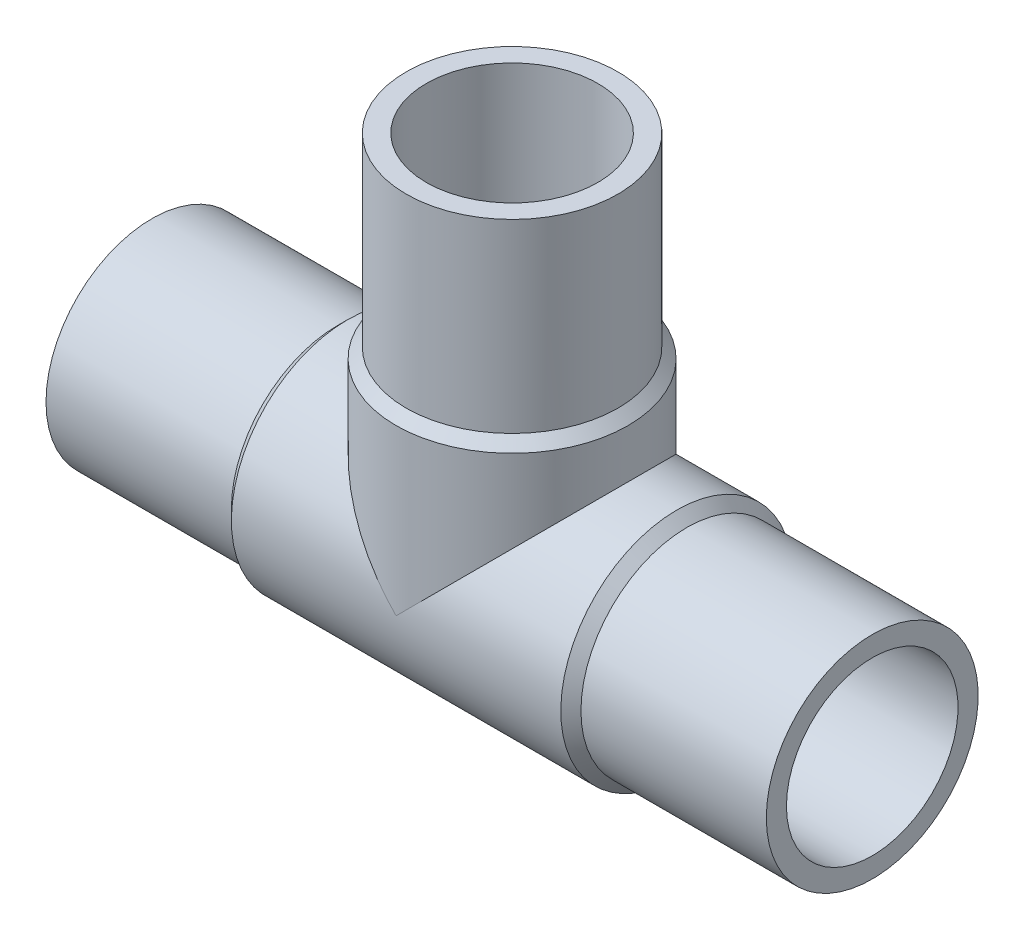
ISO-10303-21;
HEADER;
FILE_DESCRIPTION(('STEP AP214'),'2;1');
FILE_NAME('part.step','',(''),(''),'','','');
FILE_SCHEMA(('AUTOMOTIVE_DESIGN { 1 0 10303 214 1 1 1 1 }'));
ENDSEC;
DATA;
#1=APPLICATION_CONTEXT('core data for automotive mechanical design processes');
#2=APPLICATION_PROTOCOL_DEFINITION('international standard','automotive_design',2000,#1);
#3=PRODUCT_CONTEXT('',#1,'mechanical');
#4=PRODUCT('Part','Part','',(#3));
#5=PRODUCT_RELATED_PRODUCT_CATEGORY('part','',(#4));
#6=PRODUCT_DEFINITION_FORMATION('','',#4);
#7=PRODUCT_DEFINITION_CONTEXT('part definition',#1,'design');
#8=PRODUCT_DEFINITION('design','',#6,#7);
#9=PRODUCT_DEFINITION_SHAPE('','',#8);
#10=(LENGTH_UNIT() NAMED_UNIT(*) SI_UNIT(.MILLI.,.METRE.));
#11=(NAMED_UNIT(*) PLANE_ANGLE_UNIT() SI_UNIT($,.RADIAN.));
#12=(NAMED_UNIT(*) SI_UNIT($,.STERADIAN.) SOLID_ANGLE_UNIT());
#13=UNCERTAINTY_MEASURE_WITH_UNIT(LENGTH_MEASURE(1.E-05),#10,'distance_accuracy_value','');
#14=(GEOMETRIC_REPRESENTATION_CONTEXT(3) GLOBAL_UNCERTAINTY_ASSIGNED_CONTEXT((#13)) GLOBAL_UNIT_ASSIGNED_CONTEXT((#10,
#11,#12)) REPRESENTATION_CONTEXT('',''));
#15=CARTESIAN_POINT('',(0.,0.,0.));
#16=DIRECTION('',(0.,0.,1.));
#17=DIRECTION('',(1.,0.,0.));
#18=AXIS2_PLACEMENT_3D('',#15,#16,#17);
#19=CARTESIAN_POINT('',(-34.,34.,0.));
#20=DIRECTION('',(0.,1.,0.));
#21=DIRECTION('',(0.,0.,1.));
#22=AXIS2_PLACEMENT_3D('',#19,#20,#21);
#23=CYLINDRICAL_SURFACE('',#22,10.);
#24=CARTESIAN_POINT('',(-34.,34.,0.));
#25=DIRECTION('',(0.,1.,0.));
#26=DIRECTION('',(0.,0.,1.));
#27=AXIS2_PLACEMENT_3D('',#24,#25,#26);
#28=CIRCLE('',#27,10.);
#29=CARTESIAN_POINT('',(-34.,34.,10.));
#30=VERTEX_POINT('',#29);
#31=EDGE_CURVE('E18',#30,#30,#28,.T.);
#32=ORIENTED_EDGE('',*,*,#31,.F.);
#33=EDGE_LOOP('',(#32));
#34=FACE_BOUND('',#33,.T.);
#35=CARTESIAN_POINT('',(-34.,16.5,0.));
#36=DIRECTION('',(0.,1.,0.));
#37=DIRECTION('',(1.,0.,0.));
#38=AXIS2_PLACEMENT_3D('',#35,#36,#37);
#39=CIRCLE('',#38,9.99999999999999);
#40=CARTESIAN_POINT('',(-24.,16.5,0.));
#41=VERTEX_POINT('',#40);
#42=EDGE_CURVE('E71',#41,#41,#39,.F.);
#43=ORIENTED_EDGE('',*,*,#42,.F.);
#44=EDGE_LOOP('',(#43));
#45=FACE_BOUND('',#44,.T.);
#46=ADVANCED_FACE('F15',(#34,#45),#23,.T.);
#47=CARTESIAN_POINT('',(-34.,16.5,0.));
#48=DIRECTION('',(0.,-1.,0.));
#49=DIRECTION('',(0.,0.,-1.));
#50=AXIS2_PLACEMENT_3D('',#47,#48,#49);
#51=CONICAL_SURFACE('',#50,9.99999999999999,0.785398163397454);
#52=CARTESIAN_POINT('',(-34.,15.55,0.));
#53=DIRECTION('',(0.,1.,0.));
#54=DIRECTION('',(1.,0.,0.));
#55=AXIS2_PLACEMENT_3D('',#52,#53,#54);
#56=CIRCLE('',#55,10.95);
#57=CARTESIAN_POINT('',(-23.05,15.55,0.));
#58=VERTEX_POINT('',#57);
#59=EDGE_CURVE('E60',#58,#58,#56,.F.);
#60=ORIENTED_EDGE('',*,*,#59,.F.);
#61=EDGE_LOOP('',(#60));
#62=FACE_BOUND('',#61,.T.);
#63=ORIENTED_EDGE('',*,*,#42,.T.);
#64=EDGE_LOOP('',(#63));
#65=FACE_BOUND('',#64,.T.);
#66=ADVANCED_FACE('F141',(#62,#65),#51,.T.);
#67=CARTESIAN_POINT('',(-17.5,0.,0.));
#68=DIRECTION('',(-1.,0.,0.));
#69=DIRECTION('',(0.,0.,1.));
#70=AXIS2_PLACEMENT_3D('',#67,#68,#69);
#71=CYLINDRICAL_SURFACE('',#70,10.);
#72=CARTESIAN_POINT('',(-17.5,0.,0.));
#73=DIRECTION('',(1.,0.,0.));
#74=DIRECTION('',(0.,1.,0.));
#75=AXIS2_PLACEMENT_3D('',#72,#73,#74);
#76=CIRCLE('',#75,10.);
#77=CARTESIAN_POINT('',(-17.5,10.,0.));
#78=VERTEX_POINT('',#77);
#79=EDGE_CURVE('E64',#78,#78,#76,.F.);
#80=ORIENTED_EDGE('',*,*,#79,.F.);
#81=EDGE_LOOP('',(#80));
#82=FACE_BOUND('',#81,.T.);
#83=CARTESIAN_POINT('',(0.,0.,0.));
#84=DIRECTION('',(-1.,0.,0.));
#85=DIRECTION('',(0.,0.,1.));
#86=AXIS2_PLACEMENT_3D('',#83,#84,#85);
#87=CIRCLE('',#86,10.);
#88=CARTESIAN_POINT('',(0.,0.,10.));
#89=VERTEX_POINT('',#88);
#90=EDGE_CURVE('E58',#89,#89,#87,.F.);
#91=ORIENTED_EDGE('',*,*,#90,.F.);
#92=EDGE_LOOP('',(#91));
#93=FACE_BOUND('',#92,.T.);
#94=ADVANCED_FACE('F136',(#82,#93),#71,.T.);
#95=CARTESIAN_POINT('',(-44.,34.,10.1200021082875));
#96=DIRECTION('',(0.,1.,0.));
#97=DIRECTION('',(1.,0.,0.));
#98=AXIS2_PLACEMENT_3D('',#95,#96,#97);
#99=PLANE('',#98);
#100=CARTESIAN_POINT('',(-34.,34.,0.));
#101=DIRECTION('',(0.,1.,0.));
#102=DIRECTION('',(0.,0.,1.));
#103=AXIS2_PLACEMENT_3D('',#100,#101,#102);
#104=CIRCLE('',#103,8.1);
#105=CARTESIAN_POINT('',(-34.,34.,8.1));
#106=VERTEX_POINT('',#105);
#107=EDGE_CURVE('E52',#106,#106,#104,.T.);
#108=ORIENTED_EDGE('',*,*,#107,.F.);
#109=EDGE_LOOP('',(#108));
#110=FACE_BOUND('',#109,.T.);
#111=ORIENTED_EDGE('',*,*,#31,.T.);
#112=EDGE_LOOP('',(#111));
#113=FACE_BOUND('',#112,.T.);
#114=ADVANCED_FACE('F130',(#110,#113),#99,.T.);
#115=CARTESIAN_POINT('',(-17.5,0.,0.));
#116=DIRECTION('',(-1.,0.,0.));
#117=DIRECTION('',(0.,0.,1.));
#118=AXIS2_PLACEMENT_3D('',#115,#116,#117);
#119=CONICAL_SURFACE('',#118,10.,0.785398163397438);
#120=ORIENTED_EDGE('',*,*,#79,.T.);
#121=EDGE_LOOP('',(#120));
#122=FACE_BOUND('',#121,.T.);
#123=CARTESIAN_POINT('',(-18.45,0.,0.));
#124=DIRECTION('',(-1.,0.,0.));
#125=DIRECTION('',(0.,1.,0.));
#126=AXIS2_PLACEMENT_3D('',#123,#124,#125);
#127=CIRCLE('',#126,10.95);
#128=CARTESIAN_POINT('',(-18.45,10.95,0.));
#129=VERTEX_POINT('',#128);
#130=EDGE_CURVE('E49',#129,#129,#127,.T.);
#131=ORIENTED_EDGE('',*,*,#130,.F.);
#132=EDGE_LOOP('',(#131));
#133=FACE_BOUND('',#132,.T.);
#134=ADVANCED_FACE('F95',(#122,#133),#119,.T.);
#135=CARTESIAN_POINT('',(-34.,15.55,0.));
#136=DIRECTION('',(0.,1.,0.));
#137=DIRECTION('',(0.,0.,1.));
#138=AXIS2_PLACEMENT_3D('',#135,#136,#137);
#139=CYLINDRICAL_SURFACE('',#138,10.95);
#140=CARTESIAN_POINT('',(-34.,0.,0.));
#141=DIRECTION('',(0.707106781186547,0.707106781186547,0.));
#142=DIRECTION('',(-0.707106781186547,0.707106781186547,0.));
#143=AXIS2_PLACEMENT_3D('',#140,#141,#142);
#144=ELLIPSE('',#143,15.4856385079854,10.95);
#145=CARTESIAN_POINT('',(-34.,0.,10.95));
#146=VERTEX_POINT('',#145);
#147=CARTESIAN_POINT('',(-34.,0.,-10.95));
#148=VERTEX_POINT('',#147);
#149=EDGE_CURVE('E44',#146,#148,#144,.F.);
#150=ORIENTED_EDGE('',*,*,#149,.F.);
#151=CARTESIAN_POINT('',(-34.,0.,0.));
#152=DIRECTION('',(-0.707106781186547,0.707106781186547,0.));
#153=DIRECTION('',(0.707106781186547,0.707106781186547,0.));
#154=AXIS2_PLACEMENT_3D('',#151,#152,#153);
#155=ELLIPSE('',#154,15.4856385079854,10.95);
#156=EDGE_CURVE('E40',#148,#146,#155,.F.);
#157=ORIENTED_EDGE('',*,*,#156,.F.);
#158=EDGE_LOOP('',(#150,#157));
#159=FACE_BOUND('',#158,.T.);
#160=ORIENTED_EDGE('',*,*,#59,.T.);
#161=EDGE_LOOP('',(#160));
#162=FACE_BOUND('',#161,.T.);
#163=ADVANCED_FACE('F47',(#159,#162),#139,.T.);
#164=CARTESIAN_POINT('',(0.,10.,10.1200021082709));
#165=DIRECTION('',(1.,0.,0.));
#166=DIRECTION('',(0.,-1.,0.));
#167=AXIS2_PLACEMENT_3D('',#164,#165,#166);
#168=PLANE('',#167);
#169=CARTESIAN_POINT('',(0.,0.,0.));
#170=DIRECTION('',(-1.,0.,0.));
#171=DIRECTION('',(0.,0.,1.));
#172=AXIS2_PLACEMENT_3D('',#169,#170,#171);
#173=CIRCLE('',#172,8.1);
#174=CARTESIAN_POINT('',(0.,0.,8.1));
#175=VERTEX_POINT('',#174);
#176=EDGE_CURVE('E45',#175,#175,#173,.F.);
#177=ORIENTED_EDGE('',*,*,#176,.F.);
#178=EDGE_LOOP('',(#177));
#179=FACE_BOUND('',#178,.T.);
#180=ORIENTED_EDGE('',*,*,#90,.T.);
#181=EDGE_LOOP('',(#180));
#182=FACE_BOUND('',#181,.T.);
#183=ADVANCED_FACE('F85',(#179,#182),#168,.T.);
#184=CARTESIAN_POINT('',(-34.,0.,0.));
#185=DIRECTION('',(0.,1.,0.));
#186=DIRECTION('',(0.,0.,1.));
#187=AXIS2_PLACEMENT_3D('',#184,#185,#186);
#188=CYLINDRICAL_SURFACE('',#187,8.1);
#189=CARTESIAN_POINT('',(-34.,0.,0.));
#190=DIRECTION('',(-0.707106781186547,-0.707106781186547,0.));
#191=DIRECTION('',(-0.707106781186547,0.707106781186547,0.));
#192=AXIS2_PLACEMENT_3D('',#189,#190,#191);
#193=ELLIPSE('',#192,11.4551298552221,8.1);
#194=CARTESIAN_POINT('',(-34.,0.,-8.1));
#195=VERTEX_POINT('',#194);
#196=CARTESIAN_POINT('',(-34.,0.,8.1));
#197=VERTEX_POINT('',#196);
#198=EDGE_CURVE('E78',#195,#197,#193,.F.);
#199=ORIENTED_EDGE('',*,*,#198,.F.);
#200=CARTESIAN_POINT('',(-34.,0.,0.));
#201=DIRECTION('',(-0.707106781186547,0.707106781186547,0.));
#202=DIRECTION('',(0.707106781186547,0.707106781186547,0.));
#203=AXIS2_PLACEMENT_3D('',#200,#201,#202);
#204=ELLIPSE('',#203,11.4551298552221,8.1);
#205=EDGE_CURVE('E32',#195,#197,#204,.F.);
#206=ORIENTED_EDGE('',*,*,#205,.T.);
#207=EDGE_LOOP('',(#199,#206));
#208=FACE_BOUND('',#207,.T.);
#209=ORIENTED_EDGE('',*,*,#107,.T.);
#210=EDGE_LOOP('',(#209));
#211=FACE_BOUND('',#210,.T.);
#212=ADVANCED_FACE('F87',(#208,#211),#188,.F.);
#213=CARTESIAN_POINT('',(-49.55,0.,0.));
#214=DIRECTION('',(-1.,0.,0.));
#215=DIRECTION('',(0.,0.,1.));
#216=AXIS2_PLACEMENT_3D('',#213,#214,#215);
#217=CYLINDRICAL_SURFACE('',#216,10.95);
#218=ORIENTED_EDGE('',*,*,#130,.T.);
#219=EDGE_LOOP('',(#218));
#220=FACE_BOUND('',#219,.T.);
#221=CARTESIAN_POINT('',(-49.55,0.,0.));
#222=DIRECTION('',(-1.,0.,0.));
#223=DIRECTION('',(0.,1.,0.));
#224=AXIS2_PLACEMENT_3D('',#221,#222,#223);
#225=CIRCLE('',#224,10.95);
#226=CARTESIAN_POINT('',(-49.55,10.95,0.));
#227=VERTEX_POINT('',#226);
#228=EDGE_CURVE('E77',#227,#227,#225,.T.);
#229=ORIENTED_EDGE('',*,*,#228,.F.);
#230=EDGE_LOOP('',(#229));
#231=FACE_BOUND('',#230,.T.);
#232=ORIENTED_EDGE('',*,*,#149,.T.);
#233=ORIENTED_EDGE('',*,*,#156,.T.);
#234=EDGE_LOOP('',(#232,#233));
#235=FACE_BOUND('',#234,.T.);
#236=ADVANCED_FACE('F43',(#220,#231,#235),#217,.T.);
#237=CARTESIAN_POINT('',(-34.,0.,0.));
#238=DIRECTION('',(-1.,0.,0.));
#239=DIRECTION('',(0.,0.,1.));
#240=AXIS2_PLACEMENT_3D('',#237,#238,#239);
#241=CYLINDRICAL_SURFACE('',#240,8.1);
#242=ORIENTED_EDGE('',*,*,#205,.F.);
#243=ORIENTED_EDGE('',*,*,#198,.T.);
#244=EDGE_LOOP('',(#242,#243));
#245=FACE_BOUND('',#244,.T.);
#246=ORIENTED_EDGE('',*,*,#176,.T.);
#247=EDGE_LOOP('',(#246));
#248=FACE_BOUND('',#247,.T.);
#249=CARTESIAN_POINT('',(-68.,0.,0.));
#250=DIRECTION('',(-1.,0.,0.));
#251=DIRECTION('',(0.,0.,1.));
#252=AXIS2_PLACEMENT_3D('',#249,#250,#251);
#253=CIRCLE('',#252,8.1);
#254=CARTESIAN_POINT('',(-68.,0.,8.1));
#255=VERTEX_POINT('',#254);
#256=EDGE_CURVE('E74',#255,#255,#253,.F.);
#257=ORIENTED_EDGE('',*,*,#256,.F.);
#258=EDGE_LOOP('',(#257));
#259=FACE_BOUND('',#258,.T.);
#260=ADVANCED_FACE('F82',(#245,#248,#259),#241,.F.);
#261=CARTESIAN_POINT('',(-50.5,0.,0.));
#262=DIRECTION('',(1.,0.,0.));
#263=DIRECTION('',(0.,0.,-1.));
#264=AXIS2_PLACEMENT_3D('',#261,#262,#263);
#265=CONICAL_SURFACE('',#264,10.,0.785398163397438);
#266=ORIENTED_EDGE('',*,*,#228,.T.);
#267=EDGE_LOOP('',(#266));
#268=FACE_BOUND('',#267,.T.);
#269=CARTESIAN_POINT('',(-50.5,0.,0.));
#270=DIRECTION('',(-1.,0.,0.));
#271=DIRECTION('',(0.,1.,0.));
#272=AXIS2_PLACEMENT_3D('',#269,#270,#271);
#273=CIRCLE('',#272,10.);
#274=CARTESIAN_POINT('',(-50.5,10.,0.));
#275=VERTEX_POINT('',#274);
#276=EDGE_CURVE('E24',#275,#275,#273,.T.);
#277=ORIENTED_EDGE('',*,*,#276,.F.);
#278=EDGE_LOOP('',(#277));
#279=FACE_BOUND('',#278,.T.);
#280=ADVANCED_FACE('F105',(#268,#279),#265,.T.);
#281=CARTESIAN_POINT('',(-68.,-10.,10.120002108255));
#282=DIRECTION('',(-1.,0.,0.));
#283=DIRECTION('',(0.,1.,0.));
#284=AXIS2_PLACEMENT_3D('',#281,#282,#283);
#285=PLANE('',#284);
#286=ORIENTED_EDGE('',*,*,#256,.T.);
#287=EDGE_LOOP('',(#286));
#288=FACE_BOUND('',#287,.T.);
#289=CARTESIAN_POINT('',(-68.,0.,0.));
#290=DIRECTION('',(-1.,0.,0.));
#291=DIRECTION('',(0.,0.,1.));
#292=AXIS2_PLACEMENT_3D('',#289,#290,#291);
#293=CIRCLE('',#292,10.);
#294=CARTESIAN_POINT('',(-68.,0.,10.));
#295=VERTEX_POINT('',#294);
#296=EDGE_CURVE('E9',#295,#295,#293,.F.);
#297=ORIENTED_EDGE('',*,*,#296,.F.);
#298=EDGE_LOOP('',(#297));
#299=FACE_BOUND('',#298,.T.);
#300=ADVANCED_FACE('F99',(#288,#299),#285,.T.);
#301=CARTESIAN_POINT('',(-68.,0.,0.));
#302=DIRECTION('',(-1.,0.,0.));
#303=DIRECTION('',(0.,0.,1.));
#304=AXIS2_PLACEMENT_3D('',#301,#302,#303);
#305=CYLINDRICAL_SURFACE('',#304,10.);
#306=ORIENTED_EDGE('',*,*,#276,.T.);
#307=EDGE_LOOP('',(#306));
#308=FACE_BOUND('',#307,.T.);
#309=ORIENTED_EDGE('',*,*,#296,.T.);
#310=EDGE_LOOP('',(#309));
#311=FACE_BOUND('',#310,.T.);
#312=ADVANCED_FACE('F97',(#308,#311),#305,.T.);
#313=CLOSED_SHELL('',(#46,#66,#94,#114,#134,#163,#183,#212,#236,#260,#280,#300,#312));
#314=MANIFOLD_SOLID_BREP('B1',#313);
#315=ADVANCED_BREP_SHAPE_REPRESENTATION('',(#18,#314),#14);
#316=SHAPE_DEFINITION_REPRESENTATION(#9,#315);
ENDSEC;
END-ISO-10303-21;
